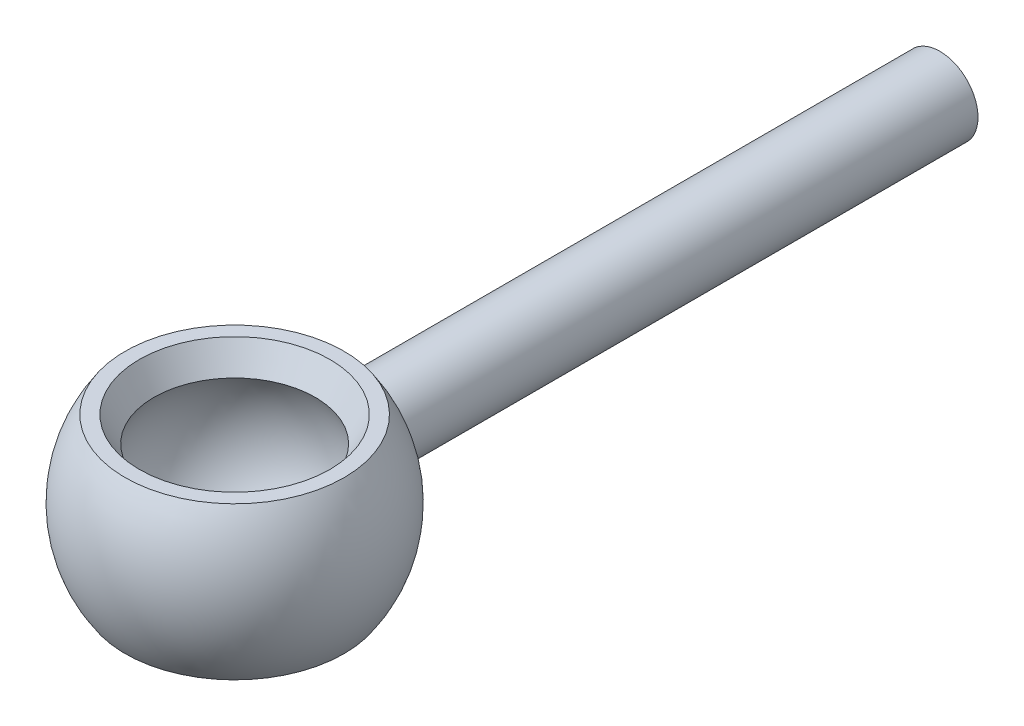
ISO-10303-21;
HEADER;
FILE_DESCRIPTION(('STEP AP214'),'2;1');
FILE_NAME('part.step','',(''),(''),'','','');
FILE_SCHEMA(('AUTOMOTIVE_DESIGN { 1 0 10303 214 1 1 1 1 }'));
ENDSEC;
DATA;
#1=APPLICATION_CONTEXT('core data for automotive mechanical design processes');
#2=APPLICATION_PROTOCOL_DEFINITION('international standard','automotive_design',2000,#1);
#3=PRODUCT_CONTEXT('',#1,'mechanical');
#4=PRODUCT('Part','Part','',(#3));
#5=PRODUCT_RELATED_PRODUCT_CATEGORY('part','',(#4));
#6=PRODUCT_DEFINITION_FORMATION('','',#4);
#7=PRODUCT_DEFINITION_CONTEXT('part definition',#1,'design');
#8=PRODUCT_DEFINITION('design','',#6,#7);
#9=PRODUCT_DEFINITION_SHAPE('','',#8);
#10=(LENGTH_UNIT() NAMED_UNIT(*) SI_UNIT(.MILLI.,.METRE.));
#11=(NAMED_UNIT(*) PLANE_ANGLE_UNIT() SI_UNIT($,.RADIAN.));
#12=(NAMED_UNIT(*) SI_UNIT($,.STERADIAN.) SOLID_ANGLE_UNIT());
#13=UNCERTAINTY_MEASURE_WITH_UNIT(LENGTH_MEASURE(1.E-05),#10,'distance_accuracy_value','');
#14=(GEOMETRIC_REPRESENTATION_CONTEXT(3) GLOBAL_UNCERTAINTY_ASSIGNED_CONTEXT((#13)) GLOBAL_UNIT_ASSIGNED_CONTEXT((#10,
#11,#12)) REPRESENTATION_CONTEXT('',''));
#15=CARTESIAN_POINT('',(0.,0.,0.));
#16=DIRECTION('',(0.,0.,1.));
#17=DIRECTION('',(1.,0.,0.));
#18=AXIS2_PLACEMENT_3D('',#15,#16,#17);
#19=CARTESIAN_POINT('',(0.,5.,0.));
#20=DIRECTION('',(0.,-1.,0.));
#21=DIRECTION('',(-1.,0.,0.));
#22=AXIS2_PLACEMENT_3D('',#19,#20,#21);
#23=SPHERICAL_SURFACE('',#22,7.);
#24=CARTESIAN_POINT('',(0.,1.,0.));
#25=DIRECTION('',(0.,-1.,0.));
#26=DIRECTION('',(1.,0.,0.));
#27=AXIS2_PLACEMENT_3D('',#24,#25,#26);
#28=CIRCLE('',#27,5.74456264653803);
#29=CARTESIAN_POINT('',(5.74456264653803,0.999999999999999,0.));
#30=VERTEX_POINT('',#29);
#31=EDGE_CURVE('E79',#30,#30,#28,.F.);
#32=ORIENTED_EDGE('',*,*,#31,.T.);
#33=EDGE_LOOP('',(#32));
#34=FACE_BOUND('',#33,.T.);
#35=CARTESIAN_POINT('',(0.,9.,0.));
#36=DIRECTION('',(0.,-1.,0.));
#37=DIRECTION('',(1.,0.,0.));
#38=AXIS2_PLACEMENT_3D('',#35,#36,#37);
#39=CIRCLE('',#38,5.74456264653803);
#40=CARTESIAN_POINT('',(5.74456264653803,9.,0.));
#41=VERTEX_POINT('',#40);
#42=EDGE_CURVE('E75',#41,#41,#39,.F.);
#43=ORIENTED_EDGE('',*,*,#42,.F.);
#44=EDGE_LOOP('',(#43));
#45=FACE_BOUND('',#44,.T.);
#46=CARTESIAN_POINT('',(0.,5.,-6.70820393249937));
#47=DIRECTION('',(0.,0.,1.));
#48=DIRECTION('',(1.,0.,0.));
#49=AXIS2_PLACEMENT_3D('',#46,#47,#48);
#50=CIRCLE('',#49,2.);
#51=CARTESIAN_POINT('',(2.,5.,-6.70820393249937));
#52=VERTEX_POINT('',#51);
#53=EDGE_CURVE('E87',#52,#52,#50,.T.);
#54=ORIENTED_EDGE('',*,*,#53,.T.);
#55=EDGE_LOOP('',(#54));
#56=FACE_BOUND('',#55,.T.);
#57=ADVANCED_FACE('F50',(#34,#45,#56),#23,.T.);
#58=CARTESIAN_POINT('',(0.,5.,0.));
#59=DIRECTION('',(0.,-1.,0.));
#60=DIRECTION('',(-1.,0.,0.));
#61=AXIS2_PLACEMENT_3D('',#58,#59,#60);
#62=SPHERICAL_SURFACE('',#61,5.);
#63=CARTESIAN_POINT('',(0.,2.33389122714769,0.));
#64=DIRECTION('',(0.,1.,0.));
#65=DIRECTION('',(-1.,0.,0.));
#66=AXIS2_PLACEMENT_3D('',#63,#64,#65);
#67=CIRCLE('',#66,4.22987754093661);
#68=CARTESIAN_POINT('',(-4.22987754093661,2.33389122714769,0.));
#69=VERTEX_POINT('',#68);
#70=EDGE_CURVE('E11',#69,#69,#67,.F.);
#71=CARTESIAN_POINT('',(0.,7.66610877285232,0.));
#72=DIRECTION('',(0.,-1.,0.));
#73=DIRECTION('',(1.,0.,0.));
#74=AXIS2_PLACEMENT_3D('',#71,#72,#73);
#75=CIRCLE('',#74,4.22987754093661);
#76=CARTESIAN_POINT('',(-4.22987754093661,7.66610877285232,0.));
#77=VERTEX_POINT('',#76);
#78=EDGE_CURVE('E69',#77,#77,#75,.F.);
#79=CARTESIAN_POINT('',(-4.22987754093661,2.33389122714769,0.));
#80=CARTESIAN_POINT('',(-4.26111608462575,2.38345144497982,0.));
#81=CARTESIAN_POINT('',(-4.29148282320523,2.43356113219702,0.));
#82=CARTESIAN_POINT('',(-4.3504369083731,2.53481652973377,0.));
#83=CARTESIAN_POINT('',(-4.37902425496149,2.58596224005331,0.));
#84=CARTESIAN_POINT('',(-4.43438377437539,2.68922676812699,0.));
#85=CARTESIAN_POINT('',(-4.4611559472009,2.74134558588111,0.));
#86=CARTESIAN_POINT('',(-4.51285216883812,2.8464918680123,0.));
#87=CARTESIAN_POINT('',(-4.53777621764984,2.89951933238936,0.));
#88=CARTESIAN_POINT('',(-4.58574536637766,3.00641741629363,0.));
#89=CARTESIAN_POINT('',(-4.60879046629377,3.06028803582083,0.));
#90=CARTESIAN_POINT('',(-4.65297325591948,3.16880587228369,0.));
#91=CARTESIAN_POINT('',(-4.67411094562908,3.22345308921933,0.));
#92=CARTESIAN_POINT('',(-4.71445279864116,3.33345660993545,0.));
#93=CARTESIAN_POINT('',(-4.73365696194365,3.38881291371592,0.));
#94=CARTESIAN_POINT('',(-4.77010803768358,3.50016621977412,0.));
#95=CARTESIAN_POINT('',(-4.78735495012103,3.55616322205185,0.));
#96=CARTESIAN_POINT('',(-4.81987021687522,3.66872874570258,0.));
#97=CARTESIAN_POINT('',(-4.83513857119198,3.72529726707557,0.));
#98=CARTESIAN_POINT('',(-4.86367785900632,3.83893594332498,0.));
#99=CARTESIAN_POINT('',(-4.8769487925039,3.8960060982014,0.));
#100=CARTESIAN_POINT('',(-4.90147684356541,4.01057753617458,0.));
#101=CARTESIAN_POINT('',(-4.91273396112934,4.06807881927134,0.));
#102=CARTESIAN_POINT('',(-4.93322047312188,4.18344147577101,0.));
#103=CARTESIAN_POINT('',(-4.94244986755049,4.24130284917392,0.));
#104=CARTESIAN_POINT('',(-4.95886953114488,4.35731420351341,0.));
#105=CARTESIAN_POINT('',(-4.96605980031065,4.41546418444998,0.));
#106=CARTESIAN_POINT('',(-4.97839233041764,4.53198091453372,0.));
#107=CARTESIAN_POINT('',(-4.98353459135886,4.5903476636809,0.));
#108=CARTESIAN_POINT('',(-4.99176475219354,4.70722582306441,0.));
#109=CARTESIAN_POINT('',(-4.99485265208699,4.76573723330076,0.));
#110=CARTESIAN_POINT('',(-4.99897027599023,4.88283242902474,0.));
#111=CARTESIAN_POINT('',(-5.,4.94141621451237,0.));
#112=CARTESIAN_POINT('',(-5.,5.05858378548764,0.));
#113=CARTESIAN_POINT('',(-4.99897027599023,5.11716757097527,0.));
#114=CARTESIAN_POINT('',(-4.99485265208699,5.23426276669925,0.));
#115=CARTESIAN_POINT('',(-4.99176475219353,5.29277417693559,0.));
#116=CARTESIAN_POINT('',(-4.98353459135886,5.40965233631911,0.));
#117=CARTESIAN_POINT('',(-4.97839233041764,5.46801908546629,0.));
#118=CARTESIAN_POINT('',(-4.96605980031065,5.58453581555003,0.));
#119=CARTESIAN_POINT('',(-4.95886953114488,5.6426857964866,0.));
#120=CARTESIAN_POINT('',(-4.94244986755049,5.75869715082608,0.));
#121=CARTESIAN_POINT('',(-4.93322047312188,5.816558524229,0.));
#122=CARTESIAN_POINT('',(-4.91273396112934,5.93192118072867,0.));
#123=CARTESIAN_POINT('',(-4.90147684356541,5.98942246382543,0.));
#124=CARTESIAN_POINT('',(-4.8769487925039,6.10399390179861,0.));
#125=CARTESIAN_POINT('',(-4.86367785900631,6.16106405667503,0.));
#126=CARTESIAN_POINT('',(-4.83513857119198,6.27470273292443,0.));
#127=CARTESIAN_POINT('',(-4.81987021687522,6.33127125429743,0.));
#128=CARTESIAN_POINT('',(-4.78735495012102,6.44383677794816,0.));
#129=CARTESIAN_POINT('',(-4.77010803768358,6.49983378022589,0.));
#130=CARTESIAN_POINT('',(-4.73365696194365,6.61118708628409,0.));
#131=CARTESIAN_POINT('',(-4.71445279864116,6.66654339006456,0.));
#132=CARTESIAN_POINT('',(-4.67411094562907,6.77654691078067,0.));
#133=CARTESIAN_POINT('',(-4.65297325591948,6.83119412771632,0.));
#134=CARTESIAN_POINT('',(-4.60879046629377,6.93971196417917,0.));
#135=CARTESIAN_POINT('',(-4.58574536637766,6.99358258370638,0.));
#136=CARTESIAN_POINT('',(-4.53777621764983,7.10048066761065,0.));
#137=CARTESIAN_POINT('',(-4.51285216883812,7.1535081319877,0.));
#138=CARTESIAN_POINT('',(-4.4611559472009,7.25865441411889,0.));
#139=CARTESIAN_POINT('',(-4.43438377437539,7.31077323187302,0.));
#140=CARTESIAN_POINT('',(-4.37902425496149,7.41403775994669,0.));
#141=CARTESIAN_POINT('',(-4.3504369083731,7.46518347026624,0.));
#142=CARTESIAN_POINT('',(-4.29148282320523,7.56643886780298,0.));
#143=CARTESIAN_POINT('',(-4.26111608462574,7.61654855502018,0.));
#144=CARTESIAN_POINT('',(-4.22987754093661,7.66610877285232,0.));
#145=B_SPLINE_CURVE_WITH_KNOTS('',3,(#79,#80,#81,#82,#83,#84,#85,#86,#87,#88,#89,#90,#91,#92,
#93,#94,#95,#96,#97,#98,#99,#100,#101,#102,#103,#104,#105,#106,#107,#108,#109,#110,#111,#112,
#113,#114,#115,#116,#117,#118,#119,#120,#121,#122,#123,#124,#125,#126,#127,#128,#129,#130,#131,
#132,#133,#134,#135,#136,#137,#138,#139,#140,#141,#142,#143,#144),.UNSPECIFIED.,.F.,.F.,(4,2,2,
2,2,2,2,2,2,2,2,2,2,2,2,2,2,2,2,2,2,2,2,2,2,2,2,2,2,2,2,2,4),(0.,0.175742310255359,
0.351484620510717,0.527226930766075,0.702969241021434,0.878711551276792,1.05445386153215,
1.23019617178751,1.40593848204287,1.58168079229823,1.75742310255358,1.93316541280894,
2.1089077230643,2.28465003331966,2.46039234357502,2.63613465383038,2.81187696408574,
2.98761927434109,3.16336158459645,3.33910389485181,3.51484620510717,3.69058851536253,
3.86633082561789,4.04207313587324,4.2178154461286,4.39355775638396,4.56930006663932,
4.74504237689468,4.92078468715004,5.09652699740539,5.27226930766075,5.44801161791611,
5.62375392817147),.UNSPECIFIED.);
#146=EDGE_CURVE('BSEAM109',#69,#77,#145,.T.);
#147=ORIENTED_EDGE('',*,*,#70,.T.);
#148=ORIENTED_EDGE('',*,*,#78,.T.);
#149=ORIENTED_EDGE('',*,*,#146,.T.);
#150=ORIENTED_EDGE('',*,*,#146,.F.);
#151=EDGE_LOOP('',(#147,#149,#148,#150));
#152=FACE_BOUND('',#151,.T.);
#153=ADVANCED_FACE('F109',(#152),#62,.F.);
#154=CARTESIAN_POINT('',(-7.,9.,-10.));
#155=DIRECTION('',(0.,-1.,0.));
#156=DIRECTION('',(1.,0.,0.));
#157=AXIS2_PLACEMENT_3D('',#154,#155,#156);
#158=PLANE('',#157);
#159=CARTESIAN_POINT('',(0.,9.,0.));
#160=DIRECTION('',(0.,-1.,0.));
#161=DIRECTION('',(1.,0.,0.));
#162=AXIS2_PLACEMENT_3D('',#159,#160,#161);
#163=CIRCLE('',#162,5.);
#164=CARTESIAN_POINT('',(5.,9.,0.));
#165=VERTEX_POINT('',#164);
#166=EDGE_CURVE('E64',#165,#165,#163,.T.);
#167=ORIENTED_EDGE('',*,*,#166,.T.);
#168=EDGE_LOOP('',(#167));
#169=FACE_BOUND('',#168,.T.);
#170=ORIENTED_EDGE('',*,*,#42,.T.);
#171=EDGE_LOOP('',(#170));
#172=FACE_BOUND('',#171,.T.);
#173=ADVANCED_FACE('F115',(#169,#172),#158,.F.);
#174=CARTESIAN_POINT('',(0.,7.66610877285232,0.));
#175=DIRECTION('',(0.,1.,0.));
#176=DIRECTION('',(-1.,0.,0.));
#177=AXIS2_PLACEMENT_3D('',#174,#175,#176);
#178=CONICAL_SURFACE('',#177,4.2298775409366,0.523598775598299);
#179=ORIENTED_EDGE('',*,*,#166,.F.);
#180=EDGE_LOOP('',(#179));
#181=FACE_BOUND('',#180,.T.);
#182=ORIENTED_EDGE('',*,*,#78,.F.);
#183=EDGE_LOOP('',(#182));
#184=FACE_BOUND('',#183,.T.);
#185=ADVANCED_FACE('F120',(#181,#184),#178,.F.);
#186=CARTESIAN_POINT('',(-7.,1.,-10.));
#187=DIRECTION('',(0.,-1.,0.));
#188=DIRECTION('',(1.,0.,0.));
#189=AXIS2_PLACEMENT_3D('',#186,#187,#188);
#190=PLANE('',#189);
#191=CARTESIAN_POINT('',(0.,1.,0.));
#192=DIRECTION('',(0.,-1.,0.));
#193=DIRECTION('',(1.,0.,0.));
#194=AXIS2_PLACEMENT_3D('',#191,#192,#193);
#195=CIRCLE('',#194,5.00000000000001);
#196=CARTESIAN_POINT('',(5.00000000000001,0.999999999999999,0.));
#197=VERTEX_POINT('',#196);
#198=EDGE_CURVE('E59',#197,#197,#195,.F.);
#199=ORIENTED_EDGE('',*,*,#198,.T.);
#200=EDGE_LOOP('',(#199));
#201=FACE_BOUND('',#200,.T.);
#202=ORIENTED_EDGE('',*,*,#31,.F.);
#203=EDGE_LOOP('',(#202));
#204=FACE_BOUND('',#203,.T.);
#205=ADVANCED_FACE('F105',(#201,#204),#190,.T.);
#206=CARTESIAN_POINT('',(0.,1.,0.));
#207=DIRECTION('',(0.,-1.,0.));
#208=DIRECTION('',(1.,0.,0.));
#209=AXIS2_PLACEMENT_3D('',#206,#207,#208);
#210=CONICAL_SURFACE('',#209,5.00000000000001,0.523598775598299);
#211=ORIENTED_EDGE('',*,*,#70,.F.);
#212=EDGE_LOOP('',(#211));
#213=FACE_BOUND('',#212,.T.);
#214=ORIENTED_EDGE('',*,*,#198,.F.);
#215=EDGE_LOOP('',(#214));
#216=FACE_BOUND('',#215,.T.);
#217=ADVANCED_FACE('F53',(#213,#216),#210,.F.);
#218=CARTESIAN_POINT('',(0.,5.,-37.));
#219=DIRECTION('',(0.,0.,1.));
#220=DIRECTION('',(1.,0.,0.));
#221=AXIS2_PLACEMENT_3D('',#218,#219,#220);
#222=CYLINDRICAL_SURFACE('',#221,2.);
#223=CARTESIAN_POINT('',(0.,5.,-37.));
#224=DIRECTION('',(0.,0.,-1.));
#225=DIRECTION('',(-1.,0.,0.));
#226=AXIS2_PLACEMENT_3D('',#223,#224,#225);
#227=CIRCLE('',#226,2.);
#228=CARTESIAN_POINT('',(-2.,5.,-37.));
#229=VERTEX_POINT('',#228);
#230=EDGE_CURVE('E83',#229,#229,#227,.T.);
#231=ORIENTED_EDGE('',*,*,#230,.F.);
#232=EDGE_LOOP('',(#231));
#233=FACE_BOUND('',#232,.T.);
#234=ORIENTED_EDGE('',*,*,#53,.F.);
#235=EDGE_LOOP('',(#234));
#236=FACE_BOUND('',#235,.T.);
#237=ADVANCED_FACE('F93',(#233,#236),#222,.T.);
#238=CARTESIAN_POINT('',(0.,5.,-37.));
#239=DIRECTION('',(0.,0.,-1.));
#240=DIRECTION('',(-1.,0.,0.));
#241=AXIS2_PLACEMENT_3D('',#238,#239,#240);
#242=PLANE('',#241);
#243=ORIENTED_EDGE('',*,*,#230,.T.);
#244=EDGE_LOOP('',(#243));
#245=FACE_BOUND('',#244,.T.);
#246=ADVANCED_FACE('F95',(#245),#242,.T.);
#247=CLOSED_SHELL('',(#57,#153,#173,#185,#205,#217,#237,#246));
#248=MANIFOLD_SOLID_BREP('B2',#247);
#249=ADVANCED_BREP_SHAPE_REPRESENTATION('',(#18,#248),#14);
#250=SHAPE_DEFINITION_REPRESENTATION(#9,#249);
ENDSEC;
END-ISO-10303-21;
